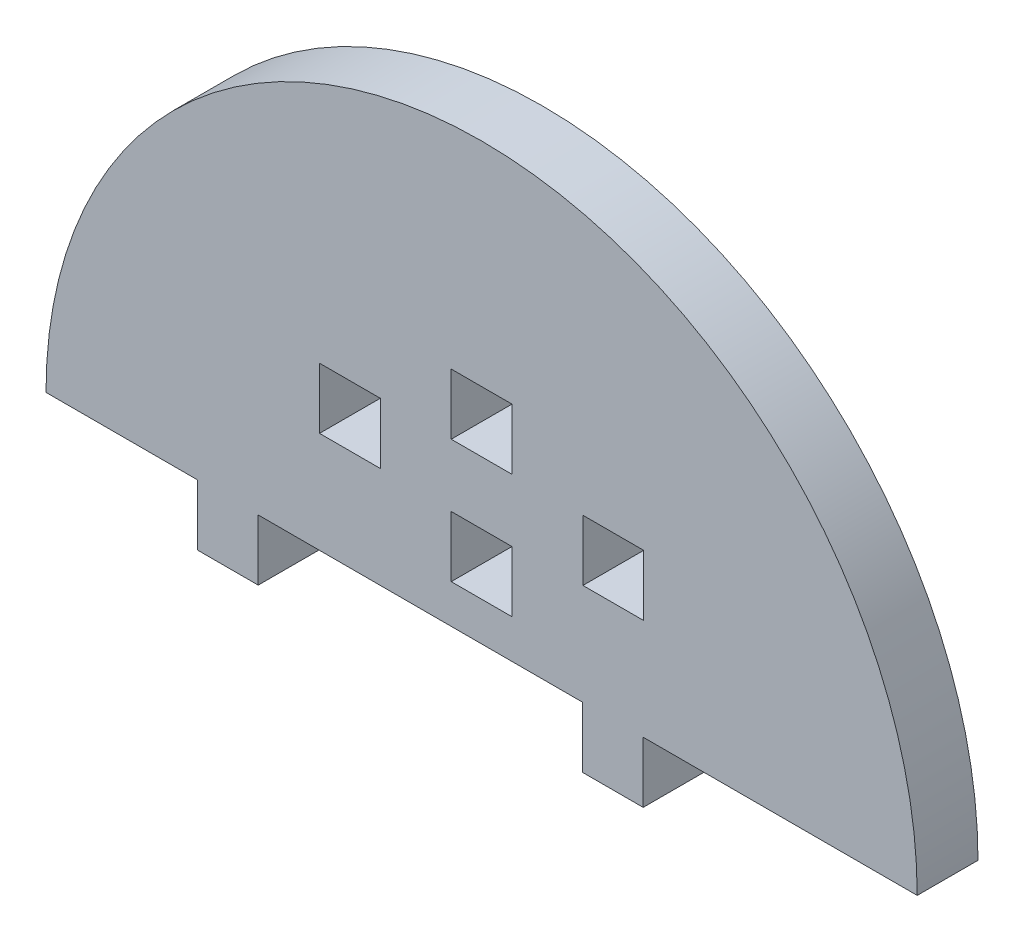
ISO-10303-21;
HEADER;
FILE_DESCRIPTION(('STEP AP214'),'2;1');
FILE_NAME('part.step','',(''),(''),'','','');
FILE_SCHEMA(('AUTOMOTIVE_DESIGN { 1 0 10303 214 1 1 1 1 }'));
ENDSEC;
DATA;
#1=APPLICATION_CONTEXT('core data for automotive mechanical design processes');
#2=APPLICATION_PROTOCOL_DEFINITION('international standard','automotive_design',2000,#1);
#3=PRODUCT_CONTEXT('',#1,'mechanical');
#4=PRODUCT('Part','Part','',(#3));
#5=PRODUCT_RELATED_PRODUCT_CATEGORY('part','',(#4));
#6=PRODUCT_DEFINITION_FORMATION('','',#4);
#7=PRODUCT_DEFINITION_CONTEXT('part definition',#1,'design');
#8=PRODUCT_DEFINITION('design','',#6,#7);
#9=PRODUCT_DEFINITION_SHAPE('','',#8);
#10=(LENGTH_UNIT() NAMED_UNIT(*) SI_UNIT(.MILLI.,.METRE.));
#11=(NAMED_UNIT(*) PLANE_ANGLE_UNIT() SI_UNIT($,.RADIAN.));
#12=(NAMED_UNIT(*) SI_UNIT($,.STERADIAN.) SOLID_ANGLE_UNIT());
#13=UNCERTAINTY_MEASURE_WITH_UNIT(LENGTH_MEASURE(1.E-05),#10,'distance_accuracy_value','');
#14=(GEOMETRIC_REPRESENTATION_CONTEXT(3) GLOBAL_UNCERTAINTY_ASSIGNED_CONTEXT((#13)) GLOBAL_UNIT_ASSIGNED_CONTEXT((#10,
#11,#12)) REPRESENTATION_CONTEXT('',''));
#15=CARTESIAN_POINT('',(0.,0.,0.));
#16=DIRECTION('',(0.,0.,1.));
#17=DIRECTION('',(1.,0.,0.));
#18=AXIS2_PLACEMENT_3D('',#15,#16,#17);
#19=CARTESIAN_POINT('',(3463.94434904042,1061.74894743644,6.));
#20=DIRECTION('',(0.,0.,1.));
#21=DIRECTION('',(1.,0.,0.));
#22=AXIS2_PLACEMENT_3D('',#19,#20,#21);
#23=PLANE('',#22);
#24=DIRECTION('',(0.,1.,0.));
#25=VECTOR('',#24,1.);
#26=CARTESIAN_POINT('',(3473.94434904042,0.,6.));
#27=LINE('',#26,#25);
#28=CARTESIAN_POINT('',(3473.94434904042,1071.74894743644,6.));
#29=VERTEX_POINT('',#28);
#30=CARTESIAN_POINT('',(3473.94434904042,1077.74894743644,6.));
#31=VERTEX_POINT('',#30);
#32=EDGE_CURVE('E417',#29,#31,#27,.T.);
#33=ORIENTED_EDGE('',*,*,#32,.T.);
#34=DIRECTION('',(1.,0.,0.));
#35=VECTOR('',#34,1.);
#36=CARTESIAN_POINT('',(0.,1077.74894743644,6.));
#37=LINE('',#36,#35);
#38=CARTESIAN_POINT('',(3479.94434904042,1077.74894743644,6.));
#39=VERTEX_POINT('',#38);
#40=EDGE_CURVE('E430',#31,#39,#37,.T.);
#41=ORIENTED_EDGE('',*,*,#40,.T.);
#42=DIRECTION('',(0.,-1.,0.));
#43=VECTOR('',#42,1.);
#44=CARTESIAN_POINT('',(3479.94434904042,0.,6.));
#45=LINE('',#44,#43);
#46=CARTESIAN_POINT('',(3479.94434904042,1071.74894743644,6.));
#47=VERTEX_POINT('',#46);
#48=EDGE_CURVE('E247',#39,#47,#45,.T.);
#49=ORIENTED_EDGE('',*,*,#48,.T.);
#50=DIRECTION('',(-1.,0.,0.));
#51=VECTOR('',#50,1.);
#52=CARTESIAN_POINT('',(0.,1071.74894743644,6.));
#53=LINE('',#52,#51);
#54=EDGE_CURVE('E409',#47,#29,#53,.T.);
#55=ORIENTED_EDGE('',*,*,#54,.T.);
#56=EDGE_LOOP('',(#33,#41,#49,#55));
#57=FACE_BOUND('',#56,.T.);
#58=DIRECTION('',(0.,1.,0.));
#59=VECTOR('',#58,1.);
#60=CARTESIAN_POINT('',(3460.94434904042,0.,6.));
#61=LINE('',#60,#59);
#62=CARTESIAN_POINT('',(3460.94434904042,1077.74894743644,6.));
#63=VERTEX_POINT('',#62);
#64=CARTESIAN_POINT('',(3460.94434904042,1083.74894743644,6.));
#65=VERTEX_POINT('',#64);
#66=EDGE_CURVE('E496',#63,#65,#61,.T.);
#67=ORIENTED_EDGE('',*,*,#66,.T.);
#68=DIRECTION('',(1.,0.,0.));
#69=VECTOR('',#68,1.);
#70=CARTESIAN_POINT('',(0.,1083.74894743644,6.));
#71=LINE('',#70,#69);
#72=CARTESIAN_POINT('',(3466.94434904042,1083.74894743644,6.));
#73=VERTEX_POINT('',#72);
#74=EDGE_CURVE('E509',#65,#73,#71,.T.);
#75=ORIENTED_EDGE('',*,*,#74,.T.);
#76=DIRECTION('',(0.,-1.,0.));
#77=VECTOR('',#76,1.);
#78=CARTESIAN_POINT('',(3466.94434904042,0.,6.));
#79=LINE('',#78,#77);
#80=CARTESIAN_POINT('',(3466.94434904042,1077.74894743644,6.));
#81=VERTEX_POINT('',#80);
#82=EDGE_CURVE('E505',#73,#81,#79,.T.);
#83=ORIENTED_EDGE('',*,*,#82,.T.);
#84=DIRECTION('',(-1.,0.,0.));
#85=VECTOR('',#84,1.);
#86=CARTESIAN_POINT('',(0.,1077.74894743644,6.));
#87=LINE('',#86,#85);
#88=EDGE_CURVE('E500',#81,#63,#87,.T.);
#89=ORIENTED_EDGE('',*,*,#88,.T.);
#90=EDGE_LOOP('',(#67,#75,#83,#89));
#91=FACE_BOUND('',#90,.T.);
#92=DIRECTION('',(1.,0.,0.));
#93=VECTOR('',#92,1.);
#94=CARTESIAN_POINT('',(3491.89298401226,1061.74894743644,6.));
#95=LINE('',#94,#93);
#96=CARTESIAN_POINT('',(3479.89298401226,1061.74894743644,6.));
#97=VERTEX_POINT('',#96);
#98=CARTESIAN_POINT('',(3506.94434904039,1061.74894743644,6.));
#99=VERTEX_POINT('',#98);
#100=EDGE_CURVE('E583',#97,#99,#95,.T.);
#101=ORIENTED_EDGE('',*,*,#100,.T.);
#102=CARTESIAN_POINT('',(3463.94434904042,1061.74894743644,6.));
#103=DIRECTION('',(0.,0.,1.));
#104=DIRECTION('',(1.,0.,0.));
#105=AXIS2_PLACEMENT_3D('',#102,#103,#104);
#106=CIRCLE('',#105,42.9999999999782);
#107=CARTESIAN_POINT('',(3420.94434904044,1061.74894743644,6.));
#108=VERTEX_POINT('',#107);
#109=EDGE_CURVE('E587',#99,#108,#106,.T.);
#110=ORIENTED_EDGE('',*,*,#109,.T.);
#111=DIRECTION('',(-1.,0.,0.));
#112=VECTOR('',#111,1.);
#113=CARTESIAN_POINT('',(3435.89298401226,1061.74894743644,6.));
#114=LINE('',#113,#112);
#115=CARTESIAN_POINT('',(3435.89298401226,1061.74894743644,6.));
#116=VERTEX_POINT('',#115);
#117=EDGE_CURVE('E591',#116,#108,#114,.T.);
#118=ORIENTED_EDGE('',*,*,#117,.F.);
#119=DIRECTION('',(0.,1.,0.));
#120=VECTOR('',#119,1.);
#121=CARTESIAN_POINT('',(3435.89298401226,1055.74894743644,6.));
#122=LINE('',#121,#120);
#123=CARTESIAN_POINT('',(3435.89298401226,1055.74894743644,6.));
#124=VERTEX_POINT('',#123);
#125=EDGE_CURVE('E595',#124,#116,#122,.T.);
#126=ORIENTED_EDGE('',*,*,#125,.F.);
#127=DIRECTION('',(-1.,0.,0.));
#128=VECTOR('',#127,1.);
#129=CARTESIAN_POINT('',(3441.89298401226,1055.74894743644,6.));
#130=LINE('',#129,#128);
#131=CARTESIAN_POINT('',(3441.89298401226,1055.74894743644,6.));
#132=VERTEX_POINT('',#131);
#133=EDGE_CURVE('E599',#132,#124,#130,.T.);
#134=ORIENTED_EDGE('',*,*,#133,.F.);
#135=DIRECTION('',(0.,-1.,0.));
#136=VECTOR('',#135,1.);
#137=CARTESIAN_POINT('',(3441.89298401226,1061.74894743644,6.));
#138=LINE('',#137,#136);
#139=CARTESIAN_POINT('',(3441.89298401226,1061.74894743644,6.));
#140=VERTEX_POINT('',#139);
#141=EDGE_CURVE('E603',#140,#132,#138,.T.);
#142=ORIENTED_EDGE('',*,*,#141,.F.);
#143=DIRECTION('',(-1.,0.,0.));
#144=VECTOR('',#143,1.);
#145=CARTESIAN_POINT('',(3463.89298401226,1061.74894743644,6.));
#146=LINE('',#145,#144);
#147=CARTESIAN_POINT('',(3473.89298401226,1061.74894743644,6.));
#148=VERTEX_POINT('',#147);
#149=EDGE_CURVE('E607',#148,#140,#146,.T.);
#150=ORIENTED_EDGE('',*,*,#149,.F.);
#151=DIRECTION('',(0.,-1.,0.));
#152=VECTOR('',#151,1.);
#153=CARTESIAN_POINT('',(3473.89298401226,1061.74894743644,6.));
#154=LINE('',#153,#152);
#155=CARTESIAN_POINT('',(3473.89298401226,1055.74894743644,6.));
#156=VERTEX_POINT('',#155);
#157=EDGE_CURVE('E611',#148,#156,#154,.T.);
#158=ORIENTED_EDGE('',*,*,#157,.T.);
#159=DIRECTION('',(1.,0.,0.));
#160=VECTOR('',#159,1.);
#161=CARTESIAN_POINT('',(3473.89298401226,1055.74894743644,6.));
#162=LINE('',#161,#160);
#163=CARTESIAN_POINT('',(3479.89298401226,1055.74894743644,6.));
#164=VERTEX_POINT('',#163);
#165=EDGE_CURVE('E614',#156,#164,#162,.T.);
#166=ORIENTED_EDGE('',*,*,#165,.T.);
#167=DIRECTION('',(0.,1.,0.));
#168=VECTOR('',#167,1.);
#169=CARTESIAN_POINT('',(3479.89298401226,1055.74894743644,6.));
#170=LINE('',#169,#168);
#171=EDGE_CURVE('E617',#164,#97,#170,.T.);
#172=ORIENTED_EDGE('',*,*,#171,.T.);
#173=EDGE_LOOP('',(#101,#110,#118,#126,#134,#142,#150,#158,#166,#172));
#174=FACE_BOUND('',#173,.T.);
#175=DIRECTION('',(0.,1.,0.));
#176=VECTOR('',#175,1.);
#177=CARTESIAN_POINT('',(3453.94434904042,0.,6.));
#178=LINE('',#177,#176);
#179=CARTESIAN_POINT('',(3453.94434904042,1071.74894743644,6.));
#180=VERTEX_POINT('',#179);
#181=CARTESIAN_POINT('',(3453.94434904042,1077.74894743644,6.));
#182=VERTEX_POINT('',#181);
#183=EDGE_CURVE('E543',#180,#182,#178,.T.);
#184=ORIENTED_EDGE('',*,*,#183,.F.);
#185=DIRECTION('',(1.,0.,0.));
#186=VECTOR('',#185,1.);
#187=CARTESIAN_POINT('',(0.,1071.74894743644,6.));
#188=LINE('',#187,#186);
#189=CARTESIAN_POINT('',(3447.94434904042,1071.74894743644,6.));
#190=VERTEX_POINT('',#189);
#191=EDGE_CURVE('E540',#190,#180,#188,.T.);
#192=ORIENTED_EDGE('',*,*,#191,.F.);
#193=DIRECTION('',(0.,-1.,0.));
#194=VECTOR('',#193,1.);
#195=CARTESIAN_POINT('',(3447.94434904042,0.,6.));
#196=LINE('',#195,#194);
#197=CARTESIAN_POINT('',(3447.94434904042,1077.74894743644,6.));
#198=VERTEX_POINT('',#197);
#199=EDGE_CURVE('E551',#198,#190,#196,.T.);
#200=ORIENTED_EDGE('',*,*,#199,.F.);
#201=DIRECTION('',(-1.,0.,0.));
#202=VECTOR('',#201,1.);
#203=CARTESIAN_POINT('',(0.,1077.74894743644,6.));
#204=LINE('',#203,#202);
#205=EDGE_CURVE('E547',#182,#198,#204,.T.);
#206=ORIENTED_EDGE('',*,*,#205,.F.);
#207=EDGE_LOOP('',(#184,#192,#200,#206));
#208=FACE_BOUND('',#207,.T.);
#209=DIRECTION('',(0.,-1.,0.));
#210=VECTOR('',#209,1.);
#211=CARTESIAN_POINT('',(3460.94434904042,0.,6.));
#212=LINE('',#211,#210);
#213=CARTESIAN_POINT('',(3460.94434904042,1071.57340626986,6.));
#214=VERTEX_POINT('',#213);
#215=CARTESIAN_POINT('',(3460.94434904042,1065.57340626986,6.));
#216=VERTEX_POINT('',#215);
#217=EDGE_CURVE('E456',#214,#216,#212,.T.);
#218=ORIENTED_EDGE('',*,*,#217,.F.);
#219=DIRECTION('',(-1.,0.,0.));
#220=VECTOR('',#219,1.);
#221=CARTESIAN_POINT('',(0.,1071.57340626986,6.));
#222=LINE('',#221,#220);
#223=CARTESIAN_POINT('',(3466.94434904042,1071.57340626986,6.));
#224=VERTEX_POINT('',#223);
#225=EDGE_CURVE('E453',#224,#214,#222,.T.);
#226=ORIENTED_EDGE('',*,*,#225,.F.);
#227=DIRECTION('',(0.,1.,0.));
#228=VECTOR('',#227,1.);
#229=CARTESIAN_POINT('',(3466.94434904042,0.,6.));
#230=LINE('',#229,#228);
#231=CARTESIAN_POINT('',(3466.94434904042,1065.57340626986,6.));
#232=VERTEX_POINT('',#231);
#233=EDGE_CURVE('E464',#232,#224,#230,.T.);
#234=ORIENTED_EDGE('',*,*,#233,.F.);
#235=DIRECTION('',(1.,0.,0.));
#236=VECTOR('',#235,1.);
#237=CARTESIAN_POINT('',(0.,1065.57340626986,6.));
#238=LINE('',#237,#236);
#239=EDGE_CURVE('E460',#216,#232,#238,.T.);
#240=ORIENTED_EDGE('',*,*,#239,.F.);
#241=EDGE_LOOP('',(#218,#226,#234,#240));
#242=FACE_BOUND('',#241,.T.);
#243=ADVANCED_FACE('F231',(#57,#91,#174,#208,#242),#23,.T.);
#244=CARTESIAN_POINT('',(3463.94434904042,1061.74894743644,0.));
#245=DIRECTION('',(0.,0.,1.));
#246=DIRECTION('',(1.,0.,0.));
#247=AXIS2_PLACEMENT_3D('',#244,#245,#246);
#248=PLANE('',#247);
#249=DIRECTION('',(1.,0.,0.));
#250=VECTOR('',#249,1.);
#251=CARTESIAN_POINT('',(0.,1077.74894743644,0.));
#252=LINE('',#251,#250);
#253=CARTESIAN_POINT('',(3473.94434904042,1077.74894743644,0.));
#254=VERTEX_POINT('',#253);
#255=CARTESIAN_POINT('',(3479.94434904042,1077.74894743644,0.));
#256=VERTEX_POINT('',#255);
#257=EDGE_CURVE('E424',#254,#256,#252,.T.);
#258=ORIENTED_EDGE('',*,*,#257,.F.);
#259=DIRECTION('',(0.,1.,0.));
#260=VECTOR('',#259,1.);
#261=CARTESIAN_POINT('',(3473.94434904042,0.,0.));
#262=LINE('',#261,#260);
#263=CARTESIAN_POINT('',(3473.94434904042,1071.74894743644,0.));
#264=VERTEX_POINT('',#263);
#265=EDGE_CURVE('E255',#264,#254,#262,.T.);
#266=ORIENTED_EDGE('',*,*,#265,.F.);
#267=DIRECTION('',(-1.,0.,0.));
#268=VECTOR('',#267,1.);
#269=CARTESIAN_POINT('',(0.,1071.74894743644,0.));
#270=LINE('',#269,#268);
#271=CARTESIAN_POINT('',(3479.94434904042,1071.74894743644,0.));
#272=VERTEX_POINT('',#271);
#273=EDGE_CURVE('E411',#272,#264,#270,.T.);
#274=ORIENTED_EDGE('',*,*,#273,.F.);
#275=DIRECTION('',(0.,-1.,0.));
#276=VECTOR('',#275,1.);
#277=CARTESIAN_POINT('',(3479.94434904042,0.,0.));
#278=LINE('',#277,#276);
#279=EDGE_CURVE('E439',#256,#272,#278,.T.);
#280=ORIENTED_EDGE('',*,*,#279,.F.);
#281=EDGE_LOOP('',(#258,#266,#274,#280));
#282=FACE_BOUND('',#281,.T.);
#283=DIRECTION('',(1.,0.,0.));
#284=VECTOR('',#283,1.);
#285=CARTESIAN_POINT('',(0.,1071.74894743644,0.));
#286=LINE('',#285,#284);
#287=CARTESIAN_POINT('',(3447.94434904042,1071.74894743644,0.));
#288=VERTEX_POINT('',#287);
#289=CARTESIAN_POINT('',(3453.94434904042,1071.74894743644,0.));
#290=VERTEX_POINT('',#289);
#291=EDGE_CURVE('E539',#288,#290,#286,.T.);
#292=ORIENTED_EDGE('',*,*,#291,.T.);
#293=DIRECTION('',(0.,1.,0.));
#294=VECTOR('',#293,1.);
#295=CARTESIAN_POINT('',(3453.94434904042,0.,0.));
#296=LINE('',#295,#294);
#297=CARTESIAN_POINT('',(3453.94434904042,1077.74894743644,0.));
#298=VERTEX_POINT('',#297);
#299=EDGE_CURVE('E558',#290,#298,#296,.T.);
#300=ORIENTED_EDGE('',*,*,#299,.T.);
#301=DIRECTION('',(-1.,0.,0.));
#302=VECTOR('',#301,1.);
#303=CARTESIAN_POINT('',(0.,1077.74894743644,0.));
#304=LINE('',#303,#302);
#305=CARTESIAN_POINT('',(3447.94434904042,1077.74894743644,0.));
#306=VERTEX_POINT('',#305);
#307=EDGE_CURVE('E562',#298,#306,#304,.T.);
#308=ORIENTED_EDGE('',*,*,#307,.T.);
#309=DIRECTION('',(0.,-1.,0.));
#310=VECTOR('',#309,1.);
#311=CARTESIAN_POINT('',(3447.94434904042,0.,0.));
#312=LINE('',#311,#310);
#313=EDGE_CURVE('E544',#306,#288,#312,.T.);
#314=ORIENTED_EDGE('',*,*,#313,.T.);
#315=EDGE_LOOP('',(#292,#300,#308,#314));
#316=FACE_BOUND('',#315,.T.);
#317=CARTESIAN_POINT('',(3463.94434904042,1061.74894743644,0.));
#318=DIRECTION('',(0.,0.,1.));
#319=DIRECTION('',(1.,0.,0.));
#320=AXIS2_PLACEMENT_3D('',#317,#318,#319);
#321=CIRCLE('',#320,42.9999999999782);
#322=CARTESIAN_POINT('',(3506.94434904039,1061.74894743644,0.));
#323=VERTEX_POINT('',#322);
#324=CARTESIAN_POINT('',(3420.94434904044,1061.74894743644,0.));
#325=VERTEX_POINT('',#324);
#326=EDGE_CURVE('E582',#323,#325,#321,.T.);
#327=ORIENTED_EDGE('',*,*,#326,.F.);
#328=DIRECTION('',(1.,0.,0.));
#329=VECTOR('',#328,1.);
#330=CARTESIAN_POINT('',(3479.89298401226,1061.74894743644,0.));
#331=LINE('',#330,#329);
#332=CARTESIAN_POINT('',(3479.89298401226,1061.74894743644,0.));
#333=VERTEX_POINT('',#332);
#334=EDGE_CURVE('E588',#333,#323,#331,.T.);
#335=ORIENTED_EDGE('',*,*,#334,.F.);
#336=DIRECTION('',(0.,1.,0.));
#337=VECTOR('',#336,1.);
#338=CARTESIAN_POINT('',(3479.89298401226,1055.74894743644,0.));
#339=LINE('',#338,#337);
#340=CARTESIAN_POINT('',(3479.89298401226,1055.74894743644,0.));
#341=VERTEX_POINT('',#340);
#342=EDGE_CURVE('E650',#341,#333,#339,.T.);
#343=ORIENTED_EDGE('',*,*,#342,.F.);
#344=DIRECTION('',(1.,0.,0.));
#345=VECTOR('',#344,1.);
#346=CARTESIAN_POINT('',(3473.89298401226,1055.74894743644,0.));
#347=LINE('',#346,#345);
#348=CARTESIAN_POINT('',(3473.89298401226,1055.74894743644,0.));
#349=VERTEX_POINT('',#348);
#350=EDGE_CURVE('E647',#349,#341,#347,.T.);
#351=ORIENTED_EDGE('',*,*,#350,.F.);
#352=DIRECTION('',(0.,-1.,0.));
#353=VECTOR('',#352,1.);
#354=CARTESIAN_POINT('',(3473.89298401226,1061.74894743644,0.));
#355=LINE('',#354,#353);
#356=CARTESIAN_POINT('',(3473.89298401226,1061.74894743644,0.));
#357=VERTEX_POINT('',#356);
#358=EDGE_CURVE('E644',#357,#349,#355,.T.);
#359=ORIENTED_EDGE('',*,*,#358,.F.);
#360=DIRECTION('',(1.,0.,0.));
#361=VECTOR('',#360,1.);
#362=CARTESIAN_POINT('',(3463.89298401226,1061.74894743644,0.));
#363=LINE('',#362,#361);
#364=CARTESIAN_POINT('',(3441.89298401226,1061.74894743644,0.));
#365=VERTEX_POINT('',#364);
#366=EDGE_CURVE('E641',#365,#357,#363,.T.);
#367=ORIENTED_EDGE('',*,*,#366,.F.);
#368=DIRECTION('',(0.,-1.,0.));
#369=VECTOR('',#368,1.);
#370=CARTESIAN_POINT('',(3441.89298401226,1061.74894743644,0.));
#371=LINE('',#370,#369);
#372=CARTESIAN_POINT('',(3441.89298401226,1055.74894743644,0.));
#373=VERTEX_POINT('',#372);
#374=EDGE_CURVE('E637',#365,#373,#371,.T.);
#375=ORIENTED_EDGE('',*,*,#374,.T.);
#376=DIRECTION('',(-1.,0.,0.));
#377=VECTOR('',#376,1.);
#378=CARTESIAN_POINT('',(3441.89298401226,1055.74894743644,0.));
#379=LINE('',#378,#377);
#380=CARTESIAN_POINT('',(3435.89298401226,1055.74894743644,0.));
#381=VERTEX_POINT('',#380);
#382=EDGE_CURVE('E633',#373,#381,#379,.T.);
#383=ORIENTED_EDGE('',*,*,#382,.T.);
#384=DIRECTION('',(0.,1.,0.));
#385=VECTOR('',#384,1.);
#386=CARTESIAN_POINT('',(3435.89298401226,1055.74894743644,0.));
#387=LINE('',#386,#385);
#388=CARTESIAN_POINT('',(3435.89298401226,1061.74894743644,0.));
#389=VERTEX_POINT('',#388);
#390=EDGE_CURVE('E629',#381,#389,#387,.T.);
#391=ORIENTED_EDGE('',*,*,#390,.T.);
#392=DIRECTION('',(-1.,0.,0.));
#393=VECTOR('',#392,1.);
#394=CARTESIAN_POINT('',(3435.89298401226,1061.74894743644,0.));
#395=LINE('',#394,#393);
#396=EDGE_CURVE('E625',#389,#325,#395,.T.);
#397=ORIENTED_EDGE('',*,*,#396,.T.);
#398=EDGE_LOOP('',(#327,#335,#343,#351,#359,#367,#375,#383,#391,#397));
#399=FACE_BOUND('',#398,.T.);
#400=DIRECTION('',(1.,0.,0.));
#401=VECTOR('',#400,1.);
#402=CARTESIAN_POINT('',(0.,1083.74894743644,0.));
#403=LINE('',#402,#401);
#404=CARTESIAN_POINT('',(3460.94434904042,1083.74894743644,0.));
#405=VERTEX_POINT('',#404);
#406=CARTESIAN_POINT('',(3466.94434904042,1083.74894743644,0.));
#407=VERTEX_POINT('',#406);
#408=EDGE_CURVE('E501',#405,#407,#403,.T.);
#409=ORIENTED_EDGE('',*,*,#408,.F.);
#410=DIRECTION('',(0.,1.,0.));
#411=VECTOR('',#410,1.);
#412=CARTESIAN_POINT('',(3460.94434904042,0.,0.));
#413=LINE('',#412,#411);
#414=CARTESIAN_POINT('',(3460.94434904042,1077.74894743644,0.));
#415=VERTEX_POINT('',#414);
#416=EDGE_CURVE('E495',#415,#405,#413,.T.);
#417=ORIENTED_EDGE('',*,*,#416,.F.);
#418=DIRECTION('',(-1.,0.,0.));
#419=VECTOR('',#418,1.);
#420=CARTESIAN_POINT('',(0.,1077.74894743644,0.));
#421=LINE('',#420,#419);
#422=CARTESIAN_POINT('',(3466.94434904042,1077.74894743644,0.));
#423=VERTEX_POINT('',#422);
#424=EDGE_CURVE('E516',#423,#415,#421,.T.);
#425=ORIENTED_EDGE('',*,*,#424,.F.);
#426=DIRECTION('',(0.,-1.,0.));
#427=VECTOR('',#426,1.);
#428=CARTESIAN_POINT('',(3466.94434904042,0.,0.));
#429=LINE('',#428,#427);
#430=EDGE_CURVE('E520',#407,#423,#429,.T.);
#431=ORIENTED_EDGE('',*,*,#430,.F.);
#432=EDGE_LOOP('',(#409,#417,#425,#431));
#433=FACE_BOUND('',#432,.T.);
#434=DIRECTION('',(-1.,0.,0.));
#435=VECTOR('',#434,1.);
#436=CARTESIAN_POINT('',(0.,1071.57340626986,0.));
#437=LINE('',#436,#435);
#438=CARTESIAN_POINT('',(3466.94434904042,1071.57340626986,0.));
#439=VERTEX_POINT('',#438);
#440=CARTESIAN_POINT('',(3460.94434904042,1071.57340626986,0.));
#441=VERTEX_POINT('',#440);
#442=EDGE_CURVE('E413',#439,#441,#437,.T.);
#443=ORIENTED_EDGE('',*,*,#442,.T.);
#444=DIRECTION('',(0.,-1.,0.));
#445=VECTOR('',#444,1.);
#446=CARTESIAN_POINT('',(3460.94434904042,0.,0.));
#447=LINE('',#446,#445);
#448=CARTESIAN_POINT('',(3460.94434904042,1065.57340626986,0.));
#449=VERTEX_POINT('',#448);
#450=EDGE_CURVE('E471',#441,#449,#447,.T.);
#451=ORIENTED_EDGE('',*,*,#450,.T.);
#452=DIRECTION('',(1.,0.,0.));
#453=VECTOR('',#452,1.);
#454=CARTESIAN_POINT('',(0.,1065.57340626986,0.));
#455=LINE('',#454,#453);
#456=CARTESIAN_POINT('',(3466.94434904042,1065.57340626986,0.));
#457=VERTEX_POINT('',#456);
#458=EDGE_CURVE('E475',#449,#457,#455,.T.);
#459=ORIENTED_EDGE('',*,*,#458,.T.);
#460=DIRECTION('',(0.,1.,0.));
#461=VECTOR('',#460,1.);
#462=CARTESIAN_POINT('',(3466.94434904042,0.,0.));
#463=LINE('',#462,#461);
#464=EDGE_CURVE('E457',#457,#439,#463,.T.);
#465=ORIENTED_EDGE('',*,*,#464,.T.);
#466=EDGE_LOOP('',(#443,#451,#459,#465));
#467=FACE_BOUND('',#466,.T.);
#468=ADVANCED_FACE('F693',(#282,#316,#399,#433,#467),#248,.F.);
#469=CARTESIAN_POINT('',(3463.94434904042,1061.74894743644,6.));
#470=DIRECTION('',(0.,0.,-1.));
#471=DIRECTION('',(-1.,0.,0.));
#472=AXIS2_PLACEMENT_3D('',#469,#470,#471);
#473=CYLINDRICAL_SURFACE('',#472,42.9999999999782);
#474=ORIENTED_EDGE('',*,*,#326,.T.);
#475=DIRECTION('',(0.,0.,-1.));
#476=VECTOR('',#475,1.);
#477=CARTESIAN_POINT('',(3420.94434904044,1061.74894743644,6.));
#478=LINE('',#477,#476);
#479=EDGE_CURVE('E240',#108,#325,#478,.T.);
#480=ORIENTED_EDGE('',*,*,#479,.F.);
#481=ORIENTED_EDGE('',*,*,#109,.F.);
#482=DIRECTION('',(0.,0.,-1.));
#483=VECTOR('',#482,1.);
#484=CARTESIAN_POINT('',(3506.94434904039,1061.74894743644,6.));
#485=LINE('',#484,#483);
#486=EDGE_CURVE('E12',#99,#323,#485,.T.);
#487=ORIENTED_EDGE('',*,*,#486,.T.);
#488=EDGE_LOOP('',(#474,#480,#481,#487));
#489=FACE_BOUND('',#488,.T.);
#490=ADVANCED_FACE('F233',(#489),#473,.T.);
#491=CARTESIAN_POINT('',(3435.89298401226,1061.74894743644,6.));
#492=DIRECTION('',(0.,-1.,0.));
#493=DIRECTION('',(0.,0.,-1.));
#494=AXIS2_PLACEMENT_3D('',#491,#492,#493);
#495=PLANE('',#494);
#496=ORIENTED_EDGE('',*,*,#396,.F.);
#497=DIRECTION('',(0.,0.,-1.));
#498=VECTOR('',#497,1.);
#499=CARTESIAN_POINT('',(3435.89298401226,1061.74894743644,6.));
#500=LINE('',#499,#498);
#501=EDGE_CURVE('E680',#116,#389,#500,.T.);
#502=ORIENTED_EDGE('',*,*,#501,.F.);
#503=ORIENTED_EDGE('',*,*,#117,.T.);
#504=ORIENTED_EDGE('',*,*,#479,.T.);
#505=EDGE_LOOP('',(#496,#502,#503,#504));
#506=FACE_BOUND('',#505,.T.);
#507=ADVANCED_FACE('F686',(#506),#495,.T.);
#508=CARTESIAN_POINT('',(3435.89298401226,1055.74894743644,6.));
#509=DIRECTION('',(-1.,0.,0.));
#510=DIRECTION('',(0.,0.,1.));
#511=AXIS2_PLACEMENT_3D('',#508,#509,#510);
#512=PLANE('',#511);
#513=ORIENTED_EDGE('',*,*,#390,.F.);
#514=DIRECTION('',(0.,0.,-1.));
#515=VECTOR('',#514,1.);
#516=CARTESIAN_POINT('',(3435.89298401226,1055.74894743644,6.));
#517=LINE('',#516,#515);
#518=EDGE_CURVE('E677',#124,#381,#517,.T.);
#519=ORIENTED_EDGE('',*,*,#518,.F.);
#520=ORIENTED_EDGE('',*,*,#125,.T.);
#521=ORIENTED_EDGE('',*,*,#501,.T.);
#522=EDGE_LOOP('',(#513,#519,#520,#521));
#523=FACE_BOUND('',#522,.T.);
#524=ADVANCED_FACE('F698',(#523),#512,.T.);
#525=CARTESIAN_POINT('',(3441.89298401226,1055.74894743644,6.));
#526=DIRECTION('',(0.,-1.,0.));
#527=DIRECTION('',(0.,0.,-1.));
#528=AXIS2_PLACEMENT_3D('',#525,#526,#527);
#529=PLANE('',#528);
#530=ORIENTED_EDGE('',*,*,#382,.F.);
#531=DIRECTION('',(0.,0.,-1.));
#532=VECTOR('',#531,1.);
#533=CARTESIAN_POINT('',(3441.89298401226,1055.74894743644,6.));
#534=LINE('',#533,#532);
#535=EDGE_CURVE('E674',#132,#373,#534,.T.);
#536=ORIENTED_EDGE('',*,*,#535,.F.);
#537=ORIENTED_EDGE('',*,*,#133,.T.);
#538=ORIENTED_EDGE('',*,*,#518,.T.);
#539=EDGE_LOOP('',(#530,#536,#537,#538));
#540=FACE_BOUND('',#539,.T.);
#541=ADVANCED_FACE('F728',(#540),#529,.T.);
#542=CARTESIAN_POINT('',(3441.89298401226,1061.74894743644,6.));
#543=DIRECTION('',(1.,0.,0.));
#544=DIRECTION('',(0.,0.,-1.));
#545=AXIS2_PLACEMENT_3D('',#542,#543,#544);
#546=PLANE('',#545);
#547=ORIENTED_EDGE('',*,*,#374,.F.);
#548=DIRECTION('',(0.,0.,-1.));
#549=VECTOR('',#548,1.);
#550=CARTESIAN_POINT('',(3441.89298401226,1061.74894743644,6.));
#551=LINE('',#550,#549);
#552=EDGE_CURVE('E670',#140,#365,#551,.T.);
#553=ORIENTED_EDGE('',*,*,#552,.F.);
#554=ORIENTED_EDGE('',*,*,#141,.T.);
#555=ORIENTED_EDGE('',*,*,#535,.T.);
#556=EDGE_LOOP('',(#547,#553,#554,#555));
#557=FACE_BOUND('',#556,.T.);
#558=ADVANCED_FACE('F726',(#557),#546,.T.);
#559=CARTESIAN_POINT('',(3463.89298401226,1061.74894743644,6.));
#560=DIRECTION('',(0.,1.,0.));
#561=DIRECTION('',(0.,0.,1.));
#562=AXIS2_PLACEMENT_3D('',#559,#560,#561);
#563=PLANE('',#562);
#564=ORIENTED_EDGE('',*,*,#366,.T.);
#565=DIRECTION('',(0.,0.,-1.));
#566=VECTOR('',#565,1.);
#567=CARTESIAN_POINT('',(3473.89298401226,1061.74894743644,6.));
#568=LINE('',#567,#566);
#569=EDGE_CURVE('E666',#148,#357,#568,.T.);
#570=ORIENTED_EDGE('',*,*,#569,.F.);
#571=ORIENTED_EDGE('',*,*,#149,.T.);
#572=ORIENTED_EDGE('',*,*,#552,.T.);
#573=EDGE_LOOP('',(#564,#570,#571,#572));
#574=FACE_BOUND('',#573,.T.);
#575=ADVANCED_FACE('F723',(#574),#563,.F.);
#576=CARTESIAN_POINT('',(3473.89298401226,1061.74894743644,6.));
#577=DIRECTION('',(1.,0.,0.));
#578=DIRECTION('',(0.,0.,-1.));
#579=AXIS2_PLACEMENT_3D('',#576,#577,#578);
#580=PLANE('',#579);
#581=ORIENTED_EDGE('',*,*,#358,.T.);
#582=DIRECTION('',(0.,0.,-1.));
#583=VECTOR('',#582,1.);
#584=CARTESIAN_POINT('',(3473.89298401226,1055.74894743644,6.));
#585=LINE('',#584,#583);
#586=EDGE_CURVE('E662',#156,#349,#585,.T.);
#587=ORIENTED_EDGE('',*,*,#586,.F.);
#588=ORIENTED_EDGE('',*,*,#157,.F.);
#589=ORIENTED_EDGE('',*,*,#569,.T.);
#590=EDGE_LOOP('',(#581,#587,#588,#589));
#591=FACE_BOUND('',#590,.T.);
#592=ADVANCED_FACE('F719',(#591),#580,.F.);
#593=CARTESIAN_POINT('',(3473.89298401226,1055.74894743644,6.));
#594=DIRECTION('',(0.,1.,0.));
#595=DIRECTION('',(0.,0.,1.));
#596=AXIS2_PLACEMENT_3D('',#593,#594,#595);
#597=PLANE('',#596);
#598=ORIENTED_EDGE('',*,*,#350,.T.);
#599=DIRECTION('',(0.,0.,-1.));
#600=VECTOR('',#599,1.);
#601=CARTESIAN_POINT('',(3479.89298401226,1055.74894743644,6.));
#602=LINE('',#601,#600);
#603=EDGE_CURVE('E658',#164,#341,#602,.T.);
#604=ORIENTED_EDGE('',*,*,#603,.F.);
#605=ORIENTED_EDGE('',*,*,#165,.F.);
#606=ORIENTED_EDGE('',*,*,#586,.T.);
#607=EDGE_LOOP('',(#598,#604,#605,#606));
#608=FACE_BOUND('',#607,.T.);
#609=ADVANCED_FACE('F715',(#608),#597,.F.);
#610=CARTESIAN_POINT('',(3479.89298401226,1055.74894743644,6.));
#611=DIRECTION('',(-1.,0.,0.));
#612=DIRECTION('',(0.,0.,1.));
#613=AXIS2_PLACEMENT_3D('',#610,#611,#612);
#614=PLANE('',#613);
#615=ORIENTED_EDGE('',*,*,#342,.T.);
#616=DIRECTION('',(0.,0.,-1.));
#617=VECTOR('',#616,1.);
#618=CARTESIAN_POINT('',(3479.89298401226,1061.74894743644,6.));
#619=LINE('',#618,#617);
#620=EDGE_CURVE('E621',#97,#333,#619,.T.);
#621=ORIENTED_EDGE('',*,*,#620,.F.);
#622=ORIENTED_EDGE('',*,*,#171,.F.);
#623=ORIENTED_EDGE('',*,*,#603,.T.);
#624=EDGE_LOOP('',(#615,#621,#622,#623));
#625=FACE_BOUND('',#624,.T.);
#626=ADVANCED_FACE('F711',(#625),#614,.F.);
#627=CARTESIAN_POINT('',(3479.89298401226,1061.74894743644,6.));
#628=DIRECTION('',(0.,1.,0.));
#629=DIRECTION('',(0.,0.,1.));
#630=AXIS2_PLACEMENT_3D('',#627,#628,#629);
#631=PLANE('',#630);
#632=ORIENTED_EDGE('',*,*,#334,.T.);
#633=ORIENTED_EDGE('',*,*,#486,.F.);
#634=ORIENTED_EDGE('',*,*,#100,.F.);
#635=ORIENTED_EDGE('',*,*,#620,.T.);
#636=EDGE_LOOP('',(#632,#633,#634,#635));
#637=FACE_BOUND('',#636,.T.);
#638=ADVANCED_FACE('F706',(#637),#631,.F.);
#639=CARTESIAN_POINT('',(0.,1071.74894743644,6.));
#640=DIRECTION('',(0.,1.,0.));
#641=DIRECTION('',(0.,0.,1.));
#642=AXIS2_PLACEMENT_3D('',#639,#640,#641);
#643=PLANE('',#642);
#644=ORIENTED_EDGE('',*,*,#291,.F.);
#645=DIRECTION('',(0.,0.,-1.));
#646=VECTOR('',#645,1.);
#647=CARTESIAN_POINT('',(3447.94434904042,1071.74894743644,6.));
#648=LINE('',#647,#646);
#649=EDGE_CURVE('E554',#190,#288,#648,.T.);
#650=ORIENTED_EDGE('',*,*,#649,.F.);
#651=ORIENTED_EDGE('',*,*,#191,.T.);
#652=DIRECTION('',(0.,0.,-1.));
#653=VECTOR('',#652,1.);
#654=CARTESIAN_POINT('',(3453.94434904042,1071.74894743644,6.));
#655=LINE('',#654,#653);
#656=EDGE_CURVE('E578',#180,#290,#655,.T.);
#657=ORIENTED_EDGE('',*,*,#656,.T.);
#658=EDGE_LOOP('',(#644,#650,#651,#657));
#659=FACE_BOUND('',#658,.T.);
#660=ADVANCED_FACE('F745',(#659),#643,.T.);
#661=CARTESIAN_POINT('',(3453.94434904042,0.,6.));
#662=DIRECTION('',(-1.,0.,0.));
#663=DIRECTION('',(0.,0.,1.));
#664=AXIS2_PLACEMENT_3D('',#661,#662,#663);
#665=PLANE('',#664);
#666=ORIENTED_EDGE('',*,*,#299,.F.);
#667=ORIENTED_EDGE('',*,*,#656,.F.);
#668=ORIENTED_EDGE('',*,*,#183,.T.);
#669=DIRECTION('',(0.,0.,-1.));
#670=VECTOR('',#669,1.);
#671=CARTESIAN_POINT('',(3453.94434904042,1077.74894743644,6.));
#672=LINE('',#671,#670);
#673=EDGE_CURVE('E575',#182,#298,#672,.T.);
#674=ORIENTED_EDGE('',*,*,#673,.T.);
#675=EDGE_LOOP('',(#666,#667,#668,#674));
#676=FACE_BOUND('',#675,.T.);
#677=ADVANCED_FACE('F783',(#676),#665,.T.);
#678=CARTESIAN_POINT('',(0.,1077.74894743644,6.));
#679=DIRECTION('',(0.,-1.,0.));
#680=DIRECTION('',(0.,0.,-1.));
#681=AXIS2_PLACEMENT_3D('',#678,#679,#680);
#682=PLANE('',#681);
#683=ORIENTED_EDGE('',*,*,#307,.F.);
#684=ORIENTED_EDGE('',*,*,#673,.F.);
#685=ORIENTED_EDGE('',*,*,#205,.T.);
#686=DIRECTION('',(0.,0.,-1.));
#687=VECTOR('',#686,1.);
#688=CARTESIAN_POINT('',(3447.94434904042,1077.74894743644,6.));
#689=LINE('',#688,#687);
#690=EDGE_CURVE('E572',#198,#306,#689,.T.);
#691=ORIENTED_EDGE('',*,*,#690,.T.);
#692=EDGE_LOOP('',(#683,#684,#685,#691));
#693=FACE_BOUND('',#692,.T.);
#694=ADVANCED_FACE('F790',(#693),#682,.T.);
#695=CARTESIAN_POINT('',(3447.94434904042,0.,6.));
#696=DIRECTION('',(1.,0.,0.));
#697=DIRECTION('',(0.,0.,-1.));
#698=AXIS2_PLACEMENT_3D('',#695,#696,#697);
#699=PLANE('',#698);
#700=ORIENTED_EDGE('',*,*,#313,.F.);
#701=ORIENTED_EDGE('',*,*,#690,.F.);
#702=ORIENTED_EDGE('',*,*,#199,.T.);
#703=ORIENTED_EDGE('',*,*,#649,.T.);
#704=EDGE_LOOP('',(#700,#701,#702,#703));
#705=FACE_BOUND('',#704,.T.);
#706=ADVANCED_FACE('F797',(#705),#699,.T.);
#707=CARTESIAN_POINT('',(3460.94434904042,0.,6.));
#708=DIRECTION('',(-1.,0.,0.));
#709=DIRECTION('',(0.,0.,1.));
#710=AXIS2_PLACEMENT_3D('',#707,#708,#709);
#711=PLANE('',#710);
#712=ORIENTED_EDGE('',*,*,#416,.T.);
#713=DIRECTION('',(0.,0.,-1.));
#714=VECTOR('',#713,1.);
#715=CARTESIAN_POINT('',(3460.94434904042,1083.74894743644,6.));
#716=LINE('',#715,#714);
#717=EDGE_CURVE('E513',#65,#405,#716,.T.);
#718=ORIENTED_EDGE('',*,*,#717,.F.);
#719=ORIENTED_EDGE('',*,*,#66,.F.);
#720=DIRECTION('',(0.,0.,-1.));
#721=VECTOR('',#720,1.);
#722=CARTESIAN_POINT('',(3460.94434904042,1077.74894743644,6.));
#723=LINE('',#722,#721);
#724=EDGE_CURVE('E536',#63,#415,#723,.T.);
#725=ORIENTED_EDGE('',*,*,#724,.T.);
#726=EDGE_LOOP('',(#712,#718,#719,#725));
#727=FACE_BOUND('',#726,.T.);
#728=ADVANCED_FACE('F805',(#727),#711,.F.);
#729=CARTESIAN_POINT('',(0.,1077.74894743644,6.));
#730=DIRECTION('',(0.,-1.,0.));
#731=DIRECTION('',(0.,0.,-1.));
#732=AXIS2_PLACEMENT_3D('',#729,#730,#731);
#733=PLANE('',#732);
#734=ORIENTED_EDGE('',*,*,#424,.T.);
#735=ORIENTED_EDGE('',*,*,#724,.F.);
#736=ORIENTED_EDGE('',*,*,#88,.F.);
#737=DIRECTION('',(0.,0.,-1.));
#738=VECTOR('',#737,1.);
#739=CARTESIAN_POINT('',(3466.94434904042,1077.74894743644,6.));
#740=LINE('',#739,#738);
#741=EDGE_CURVE('E533',#81,#423,#740,.T.);
#742=ORIENTED_EDGE('',*,*,#741,.T.);
#743=EDGE_LOOP('',(#734,#735,#736,#742));
#744=FACE_BOUND('',#743,.T.);
#745=ADVANCED_FACE('F813',(#744),#733,.F.);
#746=CARTESIAN_POINT('',(3466.94434904042,0.,6.));
#747=DIRECTION('',(1.,0.,0.));
#748=DIRECTION('',(0.,0.,-1.));
#749=AXIS2_PLACEMENT_3D('',#746,#747,#748);
#750=PLANE('',#749);
#751=ORIENTED_EDGE('',*,*,#430,.T.);
#752=ORIENTED_EDGE('',*,*,#741,.F.);
#753=ORIENTED_EDGE('',*,*,#82,.F.);
#754=DIRECTION('',(0.,0.,-1.));
#755=VECTOR('',#754,1.);
#756=CARTESIAN_POINT('',(3466.94434904042,1083.74894743644,6.));
#757=LINE('',#756,#755);
#758=EDGE_CURVE('E530',#73,#407,#757,.T.);
#759=ORIENTED_EDGE('',*,*,#758,.T.);
#760=EDGE_LOOP('',(#751,#752,#753,#759));
#761=FACE_BOUND('',#760,.T.);
#762=ADVANCED_FACE('F821',(#761),#750,.F.);
#763=CARTESIAN_POINT('',(0.,1083.74894743644,6.));
#764=DIRECTION('',(0.,1.,0.));
#765=DIRECTION('',(0.,0.,1.));
#766=AXIS2_PLACEMENT_3D('',#763,#764,#765);
#767=PLANE('',#766);
#768=ORIENTED_EDGE('',*,*,#408,.T.);
#769=ORIENTED_EDGE('',*,*,#758,.F.);
#770=ORIENTED_EDGE('',*,*,#74,.F.);
#771=ORIENTED_EDGE('',*,*,#717,.T.);
#772=EDGE_LOOP('',(#768,#769,#770,#771));
#773=FACE_BOUND('',#772,.T.);
#774=ADVANCED_FACE('F829',(#773),#767,.F.);
#775=CARTESIAN_POINT('',(0.,1071.57340626986,6.));
#776=DIRECTION('',(0.,-1.,0.));
#777=DIRECTION('',(0.,0.,-1.));
#778=AXIS2_PLACEMENT_3D('',#775,#776,#777);
#779=PLANE('',#778);
#780=ORIENTED_EDGE('',*,*,#442,.F.);
#781=DIRECTION('',(0.,0.,-1.));
#782=VECTOR('',#781,1.);
#783=CARTESIAN_POINT('',(3466.94434904042,1071.57340626986,6.));
#784=LINE('',#783,#782);
#785=EDGE_CURVE('E467',#224,#439,#784,.T.);
#786=ORIENTED_EDGE('',*,*,#785,.F.);
#787=ORIENTED_EDGE('',*,*,#225,.T.);
#788=DIRECTION('',(0.,0.,-1.));
#789=VECTOR('',#788,1.);
#790=CARTESIAN_POINT('',(3460.94434904042,1071.57340626986,6.));
#791=LINE('',#790,#789);
#792=EDGE_CURVE('E491',#214,#441,#791,.T.);
#793=ORIENTED_EDGE('',*,*,#792,.T.);
#794=EDGE_LOOP('',(#780,#786,#787,#793));
#795=FACE_BOUND('',#794,.T.);
#796=ADVANCED_FACE('F837',(#795),#779,.T.);
#797=CARTESIAN_POINT('',(3460.94434904042,0.,6.));
#798=DIRECTION('',(1.,0.,0.));
#799=DIRECTION('',(0.,0.,-1.));
#800=AXIS2_PLACEMENT_3D('',#797,#798,#799);
#801=PLANE('',#800);
#802=ORIENTED_EDGE('',*,*,#450,.F.);
#803=ORIENTED_EDGE('',*,*,#792,.F.);
#804=ORIENTED_EDGE('',*,*,#217,.T.);
#805=DIRECTION('',(0.,0.,-1.));
#806=VECTOR('',#805,1.);
#807=CARTESIAN_POINT('',(3460.94434904042,1065.57340626986,6.));
#808=LINE('',#807,#806);
#809=EDGE_CURVE('E488',#216,#449,#808,.T.);
#810=ORIENTED_EDGE('',*,*,#809,.T.);
#811=EDGE_LOOP('',(#802,#803,#804,#810));
#812=FACE_BOUND('',#811,.T.);
#813=ADVANCED_FACE('F845',(#812),#801,.T.);
#814=CARTESIAN_POINT('',(0.,1065.57340626986,6.));
#815=DIRECTION('',(0.,1.,0.));
#816=DIRECTION('',(0.,0.,1.));
#817=AXIS2_PLACEMENT_3D('',#814,#815,#816);
#818=PLANE('',#817);
#819=ORIENTED_EDGE('',*,*,#458,.F.);
#820=ORIENTED_EDGE('',*,*,#809,.F.);
#821=ORIENTED_EDGE('',*,*,#239,.T.);
#822=DIRECTION('',(0.,0.,-1.));
#823=VECTOR('',#822,1.);
#824=CARTESIAN_POINT('',(3466.94434904042,1065.57340626986,6.));
#825=LINE('',#824,#823);
#826=EDGE_CURVE('E485',#232,#457,#825,.T.);
#827=ORIENTED_EDGE('',*,*,#826,.T.);
#828=EDGE_LOOP('',(#819,#820,#821,#827));
#829=FACE_BOUND('',#828,.T.);
#830=ADVANCED_FACE('F853',(#829),#818,.T.);
#831=CARTESIAN_POINT('',(3466.94434904042,0.,6.));
#832=DIRECTION('',(-1.,0.,0.));
#833=DIRECTION('',(0.,0.,1.));
#834=AXIS2_PLACEMENT_3D('',#831,#832,#833);
#835=PLANE('',#834);
#836=ORIENTED_EDGE('',*,*,#464,.F.);
#837=ORIENTED_EDGE('',*,*,#826,.F.);
#838=ORIENTED_EDGE('',*,*,#233,.T.);
#839=ORIENTED_EDGE('',*,*,#785,.T.);
#840=EDGE_LOOP('',(#836,#837,#838,#839));
#841=FACE_BOUND('',#840,.T.);
#842=ADVANCED_FACE('F861',(#841),#835,.T.);
#843=CARTESIAN_POINT('',(3473.94434904042,0.,6.));
#844=DIRECTION('',(-1.,0.,0.));
#845=DIRECTION('',(0.,0.,1.));
#846=AXIS2_PLACEMENT_3D('',#843,#844,#845);
#847=PLANE('',#846);
#848=ORIENTED_EDGE('',*,*,#265,.T.);
#849=DIRECTION('',(0.,0.,-1.));
#850=VECTOR('',#849,1.);
#851=CARTESIAN_POINT('',(3473.94434904042,1077.74894743644,6.));
#852=LINE('',#851,#850);
#853=EDGE_CURVE('E419',#31,#254,#852,.T.);
#854=ORIENTED_EDGE('',*,*,#853,.F.);
#855=ORIENTED_EDGE('',*,*,#32,.F.);
#856=DIRECTION('',(0.,0.,-1.));
#857=VECTOR('',#856,1.);
#858=CARTESIAN_POINT('',(3473.94434904042,1071.74894743644,6.));
#859=LINE('',#858,#857);
#860=EDGE_CURVE('E405',#29,#264,#859,.T.);
#861=ORIENTED_EDGE('',*,*,#860,.T.);
#862=EDGE_LOOP('',(#848,#854,#855,#861));
#863=FACE_BOUND('',#862,.T.);
#864=ADVANCED_FACE('F418',(#863),#847,.F.);
#865=CARTESIAN_POINT('',(0.,1071.74894743644,6.));
#866=DIRECTION('',(0.,-1.,0.));
#867=DIRECTION('',(0.,0.,-1.));
#868=AXIS2_PLACEMENT_3D('',#865,#866,#867);
#869=PLANE('',#868);
#870=ORIENTED_EDGE('',*,*,#273,.T.);
#871=ORIENTED_EDGE('',*,*,#860,.F.);
#872=ORIENTED_EDGE('',*,*,#54,.F.);
#873=DIRECTION('',(0.,0.,-1.));
#874=VECTOR('',#873,1.);
#875=CARTESIAN_POINT('',(3479.94434904042,1071.74894743644,6.));
#876=LINE('',#875,#874);
#877=EDGE_CURVE('E414',#47,#272,#876,.T.);
#878=ORIENTED_EDGE('',*,*,#877,.T.);
#879=EDGE_LOOP('',(#870,#871,#872,#878));
#880=FACE_BOUND('',#879,.T.);
#881=ADVANCED_FACE('F407',(#880),#869,.F.);
#882=CARTESIAN_POINT('',(3479.94434904042,0.,6.));
#883=DIRECTION('',(1.,0.,0.));
#884=DIRECTION('',(0.,0.,-1.));
#885=AXIS2_PLACEMENT_3D('',#882,#883,#884);
#886=PLANE('',#885);
#887=ORIENTED_EDGE('',*,*,#279,.T.);
#888=ORIENTED_EDGE('',*,*,#877,.F.);
#889=ORIENTED_EDGE('',*,*,#48,.F.);
#890=DIRECTION('',(0.,0.,-1.));
#891=VECTOR('',#890,1.);
#892=CARTESIAN_POINT('',(3479.94434904042,1077.74894743644,6.));
#893=LINE('',#892,#891);
#894=EDGE_CURVE('E448',#39,#256,#893,.T.);
#895=ORIENTED_EDGE('',*,*,#894,.T.);
#896=EDGE_LOOP('',(#887,#888,#889,#895));
#897=FACE_BOUND('',#896,.T.);
#898=ADVANCED_FACE('F882',(#897),#886,.F.);
#899=CARTESIAN_POINT('',(0.,1077.74894743644,6.));
#900=DIRECTION('',(0.,1.,0.));
#901=DIRECTION('',(0.,0.,1.));
#902=AXIS2_PLACEMENT_3D('',#899,#900,#901);
#903=PLANE('',#902);
#904=ORIENTED_EDGE('',*,*,#257,.T.);
#905=ORIENTED_EDGE('',*,*,#894,.F.);
#906=ORIENTED_EDGE('',*,*,#40,.F.);
#907=ORIENTED_EDGE('',*,*,#853,.T.);
#908=EDGE_LOOP('',(#904,#905,#906,#907));
#909=FACE_BOUND('',#908,.T.);
#910=ADVANCED_FACE('F889',(#909),#903,.F.);
#911=CLOSED_SHELL('',(#243,#468,#490,#507,#524,#541,#558,#575,#592,#609,#626,#638,#660,#677,
#694,#706,#728,#745,#762,#774,#796,#813,#830,#842,#864,#881,#898,#910));
#912=MANIFOLD_SOLID_BREP('B2',#911);
#913=ADVANCED_BREP_SHAPE_REPRESENTATION('',(#18,#912),#14);
#914=SHAPE_DEFINITION_REPRESENTATION(#9,#913);
ENDSEC;
END-ISO-10303-21;
